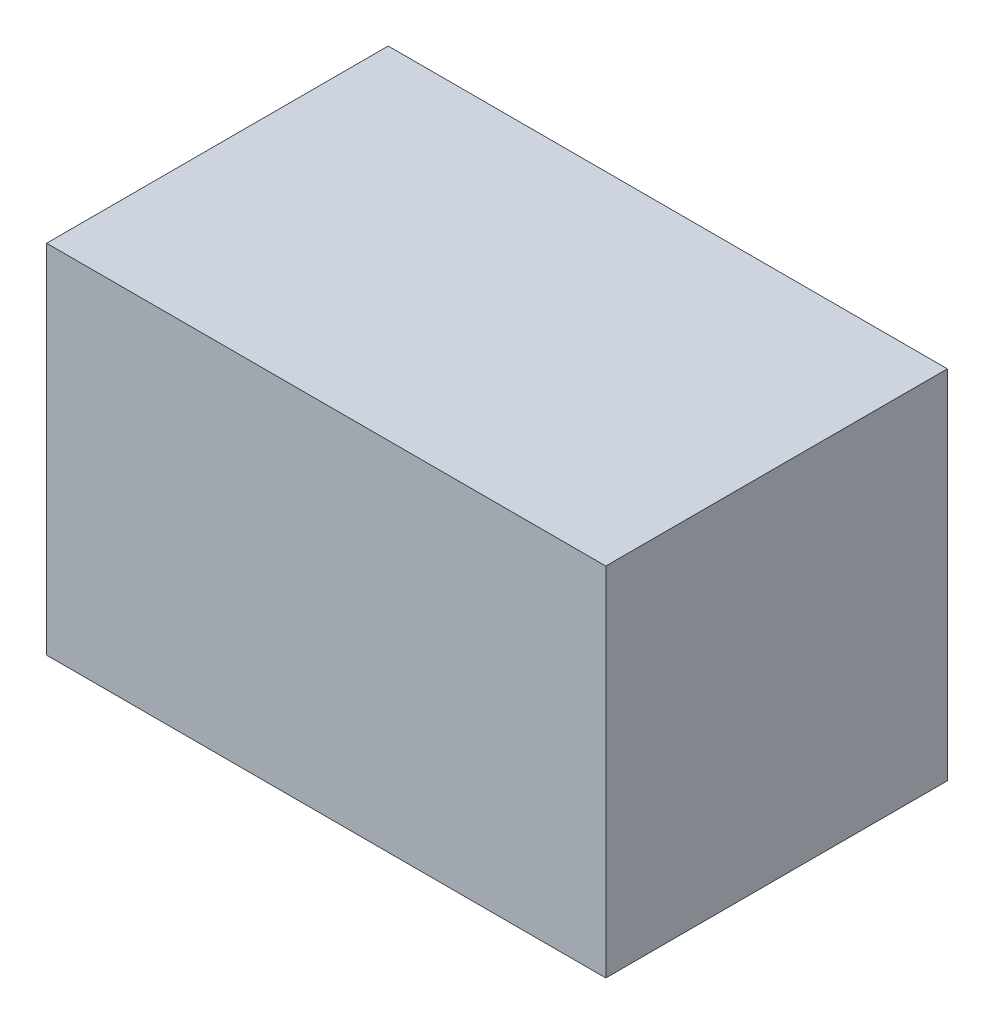
ISO-10303-21;
HEADER;
FILE_DESCRIPTION(('STEP AP214'),'2;1');
FILE_NAME('part.step','',(''),(''),'','','');
FILE_SCHEMA(('AUTOMOTIVE_DESIGN { 1 0 10303 214 1 1 1 1 }'));
ENDSEC;
DATA;
#1=APPLICATION_CONTEXT('core data for automotive mechanical design processes');
#2=APPLICATION_PROTOCOL_DEFINITION('international standard','automotive_design',2000,#1);
#3=PRODUCT_CONTEXT('',#1,'mechanical');
#4=PRODUCT('Part','Part','',(#3));
#5=PRODUCT_RELATED_PRODUCT_CATEGORY('part','',(#4));
#6=PRODUCT_DEFINITION_FORMATION('','',#4);
#7=PRODUCT_DEFINITION_CONTEXT('part definition',#1,'design');
#8=PRODUCT_DEFINITION('design','',#6,#7);
#9=PRODUCT_DEFINITION_SHAPE('','',#8);
#10=(LENGTH_UNIT() NAMED_UNIT(*) SI_UNIT(.MILLI.,.METRE.));
#11=(NAMED_UNIT(*) PLANE_ANGLE_UNIT() SI_UNIT($,.RADIAN.));
#12=(NAMED_UNIT(*) SI_UNIT($,.STERADIAN.) SOLID_ANGLE_UNIT());
#13=UNCERTAINTY_MEASURE_WITH_UNIT(LENGTH_MEASURE(1.E-05),#10,'distance_accuracy_value','');
#14=(GEOMETRIC_REPRESENTATION_CONTEXT(3) GLOBAL_UNCERTAINTY_ASSIGNED_CONTEXT((#13)) GLOBAL_UNIT_ASSIGNED_CONTEXT((#10,
#11,#12)) REPRESENTATION_CONTEXT('',''));
#15=CARTESIAN_POINT('',(0.,0.,0.));
#16=DIRECTION('',(0.,0.,1.));
#17=DIRECTION('',(1.,0.,0.));
#18=AXIS2_PLACEMENT_3D('',#15,#16,#17);
#19=CARTESIAN_POINT('',(-1.10499906,-0.70499986,1.34999984));
#20=DIRECTION('',(0.,0.,1.));
#21=DIRECTION('',(1.,0.,0.));
#22=AXIS2_PLACEMENT_3D('',#19,#20,#21);
#23=PLANE('',#22);
#24=DIRECTION('',(-1.,0.,0.));
#25=VECTOR('',#24,1.);
#26=CARTESIAN_POINT('',(1.10499906,-0.70499986,1.34999984));
#27=LINE('',#26,#25);
#28=CARTESIAN_POINT('',(1.10499906,-0.70499986,1.34999984));
#29=VERTEX_POINT('',#28);
#30=CARTESIAN_POINT('',(-1.10499906,-0.70499986,1.34999984));
#31=VERTEX_POINT('',#30);
#32=EDGE_CURVE('E25',#29,#31,#27,.T.);
#33=ORIENTED_EDGE('',*,*,#32,.F.);
#34=DIRECTION('',(0.,-1.,0.));
#35=VECTOR('',#34,1.);
#36=CARTESIAN_POINT('',(1.10499906,0.70499986,1.34999984));
#37=LINE('',#36,#35);
#38=CARTESIAN_POINT('',(1.10499906,0.70499986,1.34999984));
#39=VERTEX_POINT('',#38);
#40=EDGE_CURVE('E57',#39,#29,#37,.T.);
#41=ORIENTED_EDGE('',*,*,#40,.F.);
#42=DIRECTION('',(1.,0.,0.));
#43=VECTOR('',#42,1.);
#44=CARTESIAN_POINT('',(-1.10499906,0.70499986,1.34999984));
#45=LINE('',#44,#43);
#46=CARTESIAN_POINT('',(-1.10499906,0.70499986,1.34999984));
#47=VERTEX_POINT('',#46);
#48=EDGE_CURVE('E73',#47,#39,#45,.T.);
#49=ORIENTED_EDGE('',*,*,#48,.F.);
#50=DIRECTION('',(0.,1.,0.));
#51=VECTOR('',#50,1.);
#52=CARTESIAN_POINT('',(-1.10499906,-0.70499986,1.34999984));
#53=LINE('',#52,#51);
#54=EDGE_CURVE('E97',#31,#47,#53,.T.);
#55=ORIENTED_EDGE('',*,*,#54,.F.);
#56=EDGE_LOOP('',(#33,#41,#49,#55));
#57=FACE_BOUND('',#56,.T.);
#58=ADVANCED_FACE('F17',(#57),#23,.T.);
#59=CARTESIAN_POINT('',(-1.10499906,-0.70499986,0.));
#60=DIRECTION('',(0.,0.,1.));
#61=DIRECTION('',(1.,0.,0.));
#62=AXIS2_PLACEMENT_3D('',#59,#60,#61);
#63=PLANE('',#62);
#64=DIRECTION('',(0.,1.,0.));
#65=VECTOR('',#64,1.);
#66=CARTESIAN_POINT('',(-1.10499906,-0.70499986,0.));
#67=LINE('',#66,#65);
#68=CARTESIAN_POINT('',(-1.10499906,-0.70499986,0.));
#69=VERTEX_POINT('',#68);
#70=CARTESIAN_POINT('',(-1.10499906,0.70499986,0.));
#71=VERTEX_POINT('',#70);
#72=EDGE_CURVE('E83',#69,#71,#67,.T.);
#73=ORIENTED_EDGE('',*,*,#72,.T.);
#74=DIRECTION('',(1.,0.,0.));
#75=VECTOR('',#74,1.);
#76=CARTESIAN_POINT('',(-1.10499906,0.70499986,0.));
#77=LINE('',#76,#75);
#78=CARTESIAN_POINT('',(1.10499906,0.70499986,0.));
#79=VERTEX_POINT('',#78);
#80=EDGE_CURVE('E67',#71,#79,#77,.T.);
#81=ORIENTED_EDGE('',*,*,#80,.T.);
#82=DIRECTION('',(0.,-1.,0.));
#83=VECTOR('',#82,1.);
#84=CARTESIAN_POINT('',(1.10499906,0.70499986,0.));
#85=LINE('',#84,#83);
#86=CARTESIAN_POINT('',(1.10499906,-0.70499986,0.));
#87=VERTEX_POINT('',#86);
#88=EDGE_CURVE('E85',#79,#87,#85,.T.);
#89=ORIENTED_EDGE('',*,*,#88,.T.);
#90=DIRECTION('',(-1.,0.,0.));
#91=VECTOR('',#90,1.);
#92=CARTESIAN_POINT('',(1.10499906,-0.70499986,0.));
#93=LINE('',#92,#91);
#94=EDGE_CURVE('E11',#87,#69,#93,.T.);
#95=ORIENTED_EDGE('',*,*,#94,.T.);
#96=EDGE_LOOP('',(#73,#81,#89,#95));
#97=FACE_BOUND('',#96,.T.);
#98=ADVANCED_FACE('F82',(#97),#63,.F.);
#99=CARTESIAN_POINT('',(1.10499906,-0.70499986,0.));
#100=DIRECTION('',(0.,-1.,0.));
#101=DIRECTION('',(0.,0.,-1.));
#102=AXIS2_PLACEMENT_3D('',#99,#100,#101);
#103=PLANE('',#102);
#104=DIRECTION('',(0.,0.,1.));
#105=VECTOR('',#104,1.);
#106=CARTESIAN_POINT('',(1.10499906,-0.70499986,0.));
#107=LINE('',#106,#105);
#108=EDGE_CURVE('E114',#87,#29,#107,.T.);
#109=ORIENTED_EDGE('',*,*,#108,.T.);
#110=ORIENTED_EDGE('',*,*,#32,.T.);
#111=DIRECTION('',(0.,0.,1.));
#112=VECTOR('',#111,1.);
#113=CARTESIAN_POINT('',(-1.10499906,-0.70499986,0.));
#114=LINE('',#113,#112);
#115=EDGE_CURVE('E91',#69,#31,#114,.T.);
#116=ORIENTED_EDGE('',*,*,#115,.F.);
#117=ORIENTED_EDGE('',*,*,#94,.F.);
#118=EDGE_LOOP('',(#109,#110,#116,#117));
#119=FACE_BOUND('',#118,.T.);
#120=ADVANCED_FACE('F95',(#119),#103,.T.);
#121=CARTESIAN_POINT('',(1.10499906,0.70499986,0.));
#122=DIRECTION('',(1.,0.,0.));
#123=DIRECTION('',(0.,1.,0.));
#124=AXIS2_PLACEMENT_3D('',#121,#122,#123);
#125=PLANE('',#124);
#126=DIRECTION('',(0.,0.,1.));
#127=VECTOR('',#126,1.);
#128=CARTESIAN_POINT('',(1.10499906,0.70499986,0.));
#129=LINE('',#128,#127);
#130=EDGE_CURVE('E109',#79,#39,#129,.T.);
#131=ORIENTED_EDGE('',*,*,#130,.T.);
#132=ORIENTED_EDGE('',*,*,#40,.T.);
#133=ORIENTED_EDGE('',*,*,#108,.F.);
#134=ORIENTED_EDGE('',*,*,#88,.F.);
#135=EDGE_LOOP('',(#131,#132,#133,#134));
#136=FACE_BOUND('',#135,.T.);
#137=ADVANCED_FACE('F175',(#136),#125,.T.);
#138=CARTESIAN_POINT('',(-1.10499906,0.70499986,0.));
#139=DIRECTION('',(0.,1.,0.));
#140=DIRECTION('',(1.,0.,0.));
#141=AXIS2_PLACEMENT_3D('',#138,#139,#140);
#142=PLANE('',#141);
#143=DIRECTION('',(0.,0.,1.));
#144=VECTOR('',#143,1.);
#145=CARTESIAN_POINT('',(-1.10499906,0.70499986,0.));
#146=LINE('',#145,#144);
#147=EDGE_CURVE('E92',#71,#47,#146,.T.);
#148=ORIENTED_EDGE('',*,*,#147,.T.);
#149=ORIENTED_EDGE('',*,*,#48,.T.);
#150=ORIENTED_EDGE('',*,*,#130,.F.);
#151=ORIENTED_EDGE('',*,*,#80,.F.);
#152=EDGE_LOOP('',(#148,#149,#150,#151));
#153=FACE_BOUND('',#152,.T.);
#154=ADVANCED_FACE('F164',(#153),#142,.T.);
#155=CARTESIAN_POINT('',(-1.10499906,-0.70499986,0.));
#156=DIRECTION('',(-1.,0.,0.));
#157=DIRECTION('',(0.,0.,1.));
#158=AXIS2_PLACEMENT_3D('',#155,#156,#157);
#159=PLANE('',#158);
#160=ORIENTED_EDGE('',*,*,#115,.T.);
#161=ORIENTED_EDGE('',*,*,#54,.T.);
#162=ORIENTED_EDGE('',*,*,#147,.F.);
#163=ORIENTED_EDGE('',*,*,#72,.F.);
#164=EDGE_LOOP('',(#160,#161,#162,#163));
#165=FACE_BOUND('',#164,.T.);
#166=ADVANCED_FACE('F89',(#165),#159,.T.);
#167=CLOSED_SHELL('',(#58,#98,#120,#137,#154,#166));
#168=MANIFOLD_SOLID_BREP('B1',#167);
#169=ADVANCED_BREP_SHAPE_REPRESENTATION('',(#18,#168),#14);
#170=SHAPE_DEFINITION_REPRESENTATION(#9,#169);
ENDSEC;
END-ISO-10303-21;
